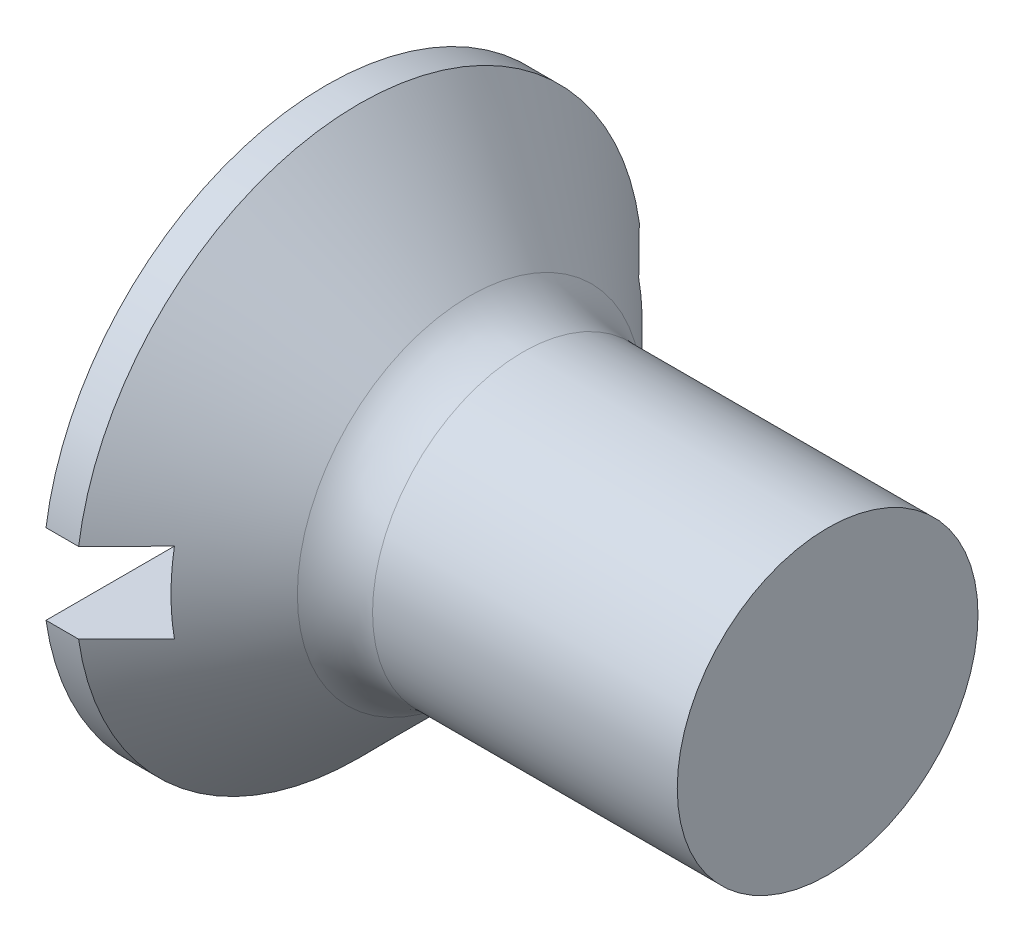
ISO-10303-21;
HEADER;
FILE_DESCRIPTION(('STEP AP214'),'2;1');
FILE_NAME('part.step','',(''),(''),'','','');
FILE_SCHEMA(('AUTOMOTIVE_DESIGN { 1 0 10303 214 1 1 1 1 }'));
ENDSEC;
DATA;
#1=APPLICATION_CONTEXT('core data for automotive mechanical design processes');
#2=APPLICATION_PROTOCOL_DEFINITION('international standard','automotive_design',2000,#1);
#3=PRODUCT_CONTEXT('',#1,'mechanical');
#4=PRODUCT('Part','Part','',(#3));
#5=PRODUCT_RELATED_PRODUCT_CATEGORY('part','',(#4));
#6=PRODUCT_DEFINITION_FORMATION('','',#4);
#7=PRODUCT_DEFINITION_CONTEXT('part definition',#1,'design');
#8=PRODUCT_DEFINITION('design','',#6,#7);
#9=PRODUCT_DEFINITION_SHAPE('','',#8);
#10=(LENGTH_UNIT() NAMED_UNIT(*) SI_UNIT(.MILLI.,.METRE.));
#11=(NAMED_UNIT(*) PLANE_ANGLE_UNIT() SI_UNIT($,.RADIAN.));
#12=(NAMED_UNIT(*) SI_UNIT($,.STERADIAN.) SOLID_ANGLE_UNIT());
#13=UNCERTAINTY_MEASURE_WITH_UNIT(LENGTH_MEASURE(1.E-05),#10,'distance_accuracy_value','');
#14=(GEOMETRIC_REPRESENTATION_CONTEXT(3) GLOBAL_UNCERTAINTY_ASSIGNED_CONTEXT((#13)) GLOBAL_UNIT_ASSIGNED_CONTEXT((#10,
#11,#12)) REPRESENTATION_CONTEXT('',''));
#15=CARTESIAN_POINT('',(0.,0.,0.));
#16=DIRECTION('',(0.,0.,1.));
#17=DIRECTION('',(1.,0.,0.));
#18=AXIS2_PLACEMENT_3D('',#15,#16,#17);
#19=CARTESIAN_POINT('',(0.,0.,0.));
#20=DIRECTION('',(-1.,0.,0.));
#21=DIRECTION('',(0.,0.,1.));
#22=AXIS2_PLACEMENT_3D('',#19,#20,#21);
#23=PLANE('',#22);
#24=DIRECTION('',(0.,0.,-1.));
#25=VECTOR('',#24,1.);
#26=CARTESIAN_POINT('',(0.,0.800000000000001,5.65));
#27=LINE('',#26,#25);
#28=CARTESIAN_POINT('',(0.,0.800000000000001,5.593076076722));
#29=VERTEX_POINT('',#28);
#30=CARTESIAN_POINT('',(0.,0.799999999999999,-5.593076076722));
#31=VERTEX_POINT('',#30);
#32=EDGE_CURVE('E169',#29,#31,#27,.T.);
#33=ORIENTED_EDGE('',*,*,#32,.F.);
#34=CARTESIAN_POINT('',(0.,0.,0.));
#35=DIRECTION('',(-1.,0.,0.));
#36=DIRECTION('',(0.,0.,1.));
#37=AXIS2_PLACEMENT_3D('',#34,#35,#36);
#38=CIRCLE('',#37,5.65);
#39=EDGE_CURVE('E113',#29,#31,#38,.T.);
#40=ORIENTED_EDGE('',*,*,#39,.T.);
#41=EDGE_LOOP('',(#33,#40));
#42=FACE_BOUND('',#41,.T.);
#43=ADVANCED_FACE('F32',(#42),#23,.T.);
#44=CARTESIAN_POINT('',(-6.34999999999999,0.,0.));
#45=DIRECTION('',(-1.,0.,0.));
#46=DIRECTION('',(0.,0.,1.));
#47=AXIS2_PLACEMENT_3D('',#44,#45,#46);
#48=CYLINDRICAL_SURFACE('',#47,5.65);
#49=DIRECTION('',(-1.,0.,0.));
#50=VECTOR('',#49,1.);
#51=CARTESIAN_POINT('',(-6.34999999999999,0.799999999999999,-5.593076076722));
#52=LINE('',#51,#50);
#53=CARTESIAN_POINT('',(0.650000000000011,0.799999999999999,-5.593076076722));
#54=VERTEX_POINT('',#53);
#55=EDGE_CURVE('E60',#31,#54,#52,.F.);
#56=ORIENTED_EDGE('',*,*,#55,.F.);
#57=ORIENTED_EDGE('',*,*,#39,.F.);
#58=DIRECTION('',(-1.,0.,0.));
#59=VECTOR('',#58,1.);
#60=CARTESIAN_POINT('',(-6.34999999999999,0.800000000000001,5.593076076722));
#61=LINE('',#60,#59);
#62=CARTESIAN_POINT('',(0.650000000000011,0.800000000000001,5.59307607672201));
#63=VERTEX_POINT('',#62);
#64=EDGE_CURVE('E175',#63,#29,#61,.T.);
#65=ORIENTED_EDGE('',*,*,#64,.F.);
#66=CARTESIAN_POINT('',(0.650000000000012,0.,0.));
#67=DIRECTION('',(-1.,0.,0.));
#68=DIRECTION('',(0.,0.,1.));
#69=AXIS2_PLACEMENT_3D('',#66,#67,#68);
#70=CIRCLE('',#69,5.65);
#71=EDGE_CURVE('E107',#63,#54,#70,.T.);
#72=ORIENTED_EDGE('',*,*,#71,.T.);
#73=EDGE_LOOP('',(#56,#57,#65,#72));
#74=FACE_BOUND('',#73,.T.);
#75=ADVANCED_FACE('F153',(#74),#48,.T.);
#76=DIRECTION('',(0.,0.,1.));
#77=VECTOR('',#76,1.);
#78=CARTESIAN_POINT('',(0.,-0.800000000000001,-5.65));
#79=LINE('',#78,#77);
#80=CARTESIAN_POINT('',(0.,-0.800000000000001,-5.593076076722));
#81=VERTEX_POINT('',#80);
#82=CARTESIAN_POINT('',(0.,-0.800000000000001,5.593076076722));
#83=VERTEX_POINT('',#82);
#84=EDGE_CURVE('E101',#81,#83,#79,.T.);
#85=ORIENTED_EDGE('',*,*,#84,.F.);
#86=EDGE_CURVE('E109',#81,#83,#38,.T.);
#87=ORIENTED_EDGE('',*,*,#86,.T.);
#88=EDGE_LOOP('',(#85,#87));
#89=FACE_BOUND('',#88,.T.);
#90=ADVANCED_FACE('F155',(#89),#23,.T.);
#91=DIRECTION('',(-1.,0.,0.));
#92=VECTOR('',#91,1.);
#93=CARTESIAN_POINT('',(-6.34999999999999,-0.800000000000001,5.593076076722));
#94=LINE('',#93,#92);
#95=CARTESIAN_POINT('',(0.650000000000011,-0.800000000000001,5.593076076722));
#96=VERTEX_POINT('',#95);
#97=EDGE_CURVE('E174',#83,#96,#94,.F.);
#98=ORIENTED_EDGE('',*,*,#97,.F.);
#99=ORIENTED_EDGE('',*,*,#86,.F.);
#100=DIRECTION('',(-1.,0.,0.));
#101=VECTOR('',#100,1.);
#102=CARTESIAN_POINT('',(-6.34999999999999,-0.800000000000001,-5.593076076722));
#103=LINE('',#102,#101);
#104=CARTESIAN_POINT('',(0.650000000000011,-0.800000000000001,-5.59307607672201));
#105=VERTEX_POINT('',#104);
#106=EDGE_CURVE('E172',#105,#81,#103,.T.);
#107=ORIENTED_EDGE('',*,*,#106,.F.);
#108=EDGE_CURVE('E110',#105,#96,#70,.T.);
#109=ORIENTED_EDGE('',*,*,#108,.T.);
#110=EDGE_LOOP('',(#98,#99,#107,#109));
#111=FACE_BOUND('',#110,.T.);
#112=ADVANCED_FACE('F150',(#111),#48,.T.);
#113=CARTESIAN_POINT('',(0.650000000000012,0.,0.));
#114=DIRECTION('',(-1.,0.,0.));
#115=DIRECTION('',(0.,0.,1.));
#116=AXIS2_PLACEMENT_3D('',#113,#114,#115);
#117=CONICAL_SURFACE('',#116,5.65,0.78539816339745);
#118=CARTESIAN_POINT('',(-6.15411798892372,0.799999999999998,-12.4283971163636));
#119=CARTESIAN_POINT('',(-5.72840936577509,0.799999999999998,-12.0018006229212));
#120=CARTESIAN_POINT('',(-5.30273955990164,0.799999999999998,-11.5751653687947));
#121=CARTESIAN_POINT('',(-4.45151919492078,0.799999999999999,-10.7217600802515));
#122=CARTESIAN_POINT('',(-4.0259686381804,0.799999999999999,-10.2949900434739));
#123=CARTESIAN_POINT('',(-3.17486613013246,0.799999999999999,-9.44109511849879));
#124=CARTESIAN_POINT('',(-2.74931425281385,0.799999999999999,-9.01397015654169));
#125=CARTESIAN_POINT('',(-1.89848797936659,0.799999999999999,-8.15945937404006));
#126=CARTESIAN_POINT('',(-1.47321357834264,0.799999999999999,-7.73207355836998));
#127=CARTESIAN_POINT('',(-0.615833138596042,0.799999999999999,-6.86957346722668));
#128=CARTESIAN_POINT('',(-0.183734469882892,0.799999999999999,-6.43445186100299));
#129=CARTESIAN_POINT('',(0.463821474491267,0.799999999999999,-5.78115808219935));
#130=CARTESIAN_POINT('',(0.679580862520891,0.799999999999999,-5.56328543468081));
#131=CARTESIAN_POINT('',(1.11080934749388,0.799999999999999,-5.12725542215657));
#132=CARTESIAN_POINT('',(1.32627844606598,0.799999999999999,-4.90909805876196));
#133=CARTESIAN_POINT('',(1.75673850138855,0.799999999999999,-4.4724245478013));
#134=CARTESIAN_POINT('',(1.9717295687097,0.799999999999999,-4.25390850932614));
#135=CARTESIAN_POINT('',(2.40105661992232,0.799999999999999,-3.81622451922108));
#136=CARTESIAN_POINT('',(2.61539258957473,0.799999999999999,-3.5970565536225));
#137=CARTESIAN_POINT('',(3.04295786491517,0.799999999999999,-3.15768240489524));
#138=CARTESIAN_POINT('',(3.25618727824565,0.8,-2.93747632688459));
#139=CARTESIAN_POINT('',(3.5744618622097,0.8,-2.60566790210966));
#140=CARTESIAN_POINT('',(3.68028997071699,0.8,-2.49481715360701));
#141=CARTESIAN_POINT('',(3.89117220729709,0.8,-2.27238250941067));
#142=CARTESIAN_POINT('',(3.9962263454492,0.8,-2.16079862330045));
#143=CARTESIAN_POINT('',(4.15723188894845,0.8,-1.98794766988223));
#144=CARTESIAN_POINT('',(4.2136059990957,0.8,-1.92707456228058));
#145=CARTESIAN_POINT('',(4.32589442529992,0.8,-1.80490303802935));
#146=CARTESIAN_POINT('',(4.38180873303286,0.8,-1.74360461371695));
#147=CARTESIAN_POINT('',(4.4929680078689,0.8,-1.62051315034739));
#148=CARTESIAN_POINT('',(4.54821358275828,0.8,-1.55872066097201));
#149=CARTESIAN_POINT('',(4.65786130918919,0.8,-1.43439270817013));
#150=CARTESIAN_POINT('',(4.71226349046958,0.8,-1.37185727107863));
#151=CARTESIAN_POINT('',(4.80409800489935,0.8,-1.26422341554116));
#152=CARTESIAN_POINT('',(4.84183289735226,0.8,-1.21938356763917));
#153=CARTESIAN_POINT('',(4.91649705496834,0.8,-1.12903902209597));
#154=CARTESIAN_POINT('',(4.9534263571778,0.8,-1.08353435518884));
#155=CARTESIAN_POINT('',(5.02626757436238,0.8,-0.991556943863383));
#156=CARTESIAN_POINT('',(5.06217715923927,0.8,-0.945082346844529));
#157=CARTESIAN_POINT('',(5.13244697424572,0.8,-0.850978080642057));
#158=CARTESIAN_POINT('',(5.16680749256612,0.8,-0.803348628866251));
#159=CARTESIAN_POINT('',(5.22431678505691,0.8,-0.719551181360363));
#160=CARTESIAN_POINT('',(5.24799439430335,0.8,-0.683748053381672));
#161=CARTESIAN_POINT('',(5.29369463170906,0.8,-0.611104859400517));
#162=CARTESIAN_POINT('',(5.31571771437161,0.8,-0.574265082019199));
#163=CARTESIAN_POINT('',(5.35744088173564,0.8,-0.499381880581155));
#164=CARTESIAN_POINT('',(5.3771460797954,0.8,-0.461341350063789));
#165=CARTESIAN_POINT('',(5.41336597509922,0.8,-0.383789778924322));
#166=CARTESIAN_POINT('',(5.42988361613627,0.8,-0.344280135684756));
#167=CARTESIAN_POINT('',(5.46094186112705,0.8,-0.256815833575109));
#168=CARTESIAN_POINT('',(5.47467792038231,0.8,-0.20856153602771));
#169=CARTESIAN_POINT('',(5.49381672990303,0.8,-0.110515093237376));
#170=CARTESIAN_POINT('',(5.49925037850747,0.8,-0.060729356954277));
#171=CARTESIAN_POINT('',(5.50060502700805,0.8,0.0392177136115987));
#172=CARTESIAN_POINT('',(5.49648099608259,0.8,0.0893797114709912));
#173=CARTESIAN_POINT('',(5.47960475780969,0.8,0.188284885251787));
#174=CARTESIAN_POINT('',(5.46682661842948,0.8,0.237023336329289));
#175=CARTESIAN_POINT('',(5.43411335720119,0.8,0.334650620188543));
#176=CARTESIAN_POINT('',(5.41385237186613,0.8,0.383425158293348));
#177=CARTESIAN_POINT('',(5.36862340606944,0.8,0.478778012709488));
#178=CARTESIAN_POINT('',(5.34364665533211,0.8,0.525352031468063));
#179=CARTESIAN_POINT('',(5.29038044021314,0.8,0.617035607546896));
#180=CARTESIAN_POINT('',(5.26206586010344,0.8,0.662130306879412));
#181=CARTESIAN_POINT('',(5.20333288339617,0.8,0.750853253487644));
#182=CARTESIAN_POINT('',(5.1729163682235,0.8,0.794482761561326));
#183=CARTESIAN_POINT('',(5.10778188580205,0.8,0.884555028346779));
#184=CARTESIAN_POINT('',(5.0729236209393,0.8,0.930895621053307));
#185=CARTESIAN_POINT('',(5.00196098633506,0.8,1.02261602365522));
#186=CARTESIAN_POINT('',(4.96585645074892,0.8,1.06799570437294));
#187=CARTESIAN_POINT('',(4.85617422837835,0.8,1.20309114485919));
#188=CARTESIAN_POINT('',(4.78126095309617,0.8,1.2917191660263));
#189=CARTESIAN_POINT('',(4.62929001014889,0.8,1.46737217769587));
#190=CARTESIAN_POINT('',(4.55222874448881,0.8,1.5543940152484));
#191=CARTESIAN_POINT('',(4.39684690056853,0.8,1.72725932532418));
#192=CARTESIAN_POINT('',(4.31852668700296,0.8,1.81310312620707));
#193=CARTESIAN_POINT('',(4.16128761098344,0.8,1.9837284827919));
#194=CARTESIAN_POINT('',(4.0823714818107,0.8,2.06851256588975));
#195=CARTESIAN_POINT('',(3.92393847595694,0.8,2.23752833083242));
#196=CARTESIAN_POINT('',(3.84442155665824,0.8,2.32175997268229));
#197=CARTESIAN_POINT('',(3.68503997077844,0.8,2.48972216949868));
#198=CARTESIAN_POINT('',(3.60517576659222,0.8,2.57345316373664));
#199=CARTESIAN_POINT('',(3.44512383250757,0.8,2.74060127143915));
#200=CARTESIAN_POINT('',(3.36493611048112,0.8,2.82401839244668));
#201=CARTESIAN_POINT('',(3.12470885427914,0.8,3.07317891766216));
#202=CARTESIAN_POINT('',(2.96430275212163,0.8,3.23856877786796));
#203=CARTESIAN_POINT('',(2.64287426918782,0.8,3.56874884446275));
#204=CARTESIAN_POINT('',(2.4818518859131,0.8,3.73353904841542));
#205=CARTESIAN_POINT('',(1.9981683934421,0.8,4.22731783608694));
#206=CARTESIAN_POINT('',(1.67489699835289,0.8,4.55570835097942));
#207=CARTESIAN_POINT('',(1.02739846590984,0.8,5.21181717990758));
#208=CARTESIAN_POINT('',(0.70317098349403,0.800000000000001,5.53953515275434));
#209=CARTESIAN_POINT('',(0.0542289424000233,0.800000000000001,6.1944827659075));
#210=CARTESIAN_POINT('',(-0.270485611958639,0.800000000000001,6.52171241049384));
#211=CARTESIAN_POINT('',(-0.920234045040373,0.800000000000001,7.17587674443067));
#212=CARTESIAN_POINT('',(-1.24526793436538,0.800000000000001,7.50281142324595));
#213=CARTESIAN_POINT('',(-1.8955454823201,0.800000000000001,8.15647358657788));
#214=CARTESIAN_POINT('',(-2.220789141434,0.800000000000001,8.48320107061281));
#215=CARTESIAN_POINT('',(-3.19666835146251,0.800000000000001,9.46309907333131));
#216=CARTESIAN_POINT('',(-3.84752047784227,0.800000000000001,10.1160538883214));
#217=CARTESIAN_POINT('',(-4.6364721110691,0.800000000000001,10.9071774138025));
#218=CARTESIAN_POINT('',(-4.77442315271538,0.800000000000001,11.0454942565746));
#219=CARTESIAN_POINT('',(-5.05034059357145,0.800000000000001,11.3221169050327));
#220=CARTESIAN_POINT('',(-5.18830699298625,0.800000000000001,11.4604227105142));
#221=CARTESIAN_POINT('',(-5.46424249913599,0.800000000000001,11.7370137404173));
#222=CARTESIAN_POINT('',(-5.60221160511629,0.800000000000001,11.8752989655918));
#223=CARTESIAN_POINT('',(-5.8781582272092,0.800000000000001,12.1518567391849));
#224=CARTESIAN_POINT('',(-6.01613574315794,0.800000000000001,12.2901292877671));
#225=CARTESIAN_POINT('',(-6.15411798892373,0.800000000000001,12.4283971163636));
#226=B_SPLINE_CURVE_WITH_KNOTS('',3,(#118,#119,#120,#121,#122,#123,#124,#125,#126,#127,#128,
#129,#130,#131,#132,#133,#134,#135,#136,#137,#138,#139,#140,#141,#142,#143,#144,#145,#146,#147,
#148,#149,#150,#151,#152,#153,#154,#155,#156,#157,#158,#159,#160,#161,#162,#163,#164,#165,#166,
#167,#168,#169,#170,#171,#172,#173,#174,#175,#176,#177,#178,#179,#180,#181,#182,#183,#184,#185,
#186,#187,#188,#189,#190,#191,#192,#193,#194,#195,#196,#197,#198,#199,#200,#201,#202,#203,#204,
#205,#206,#207,#208,#209,#210,#211,#212,#213,#214,#215,#216,#217,#218,#219,#220,#221,#222,#223,
#224,#225),.UNSPECIFIED.,.F.,.F.,(4,2,2,2,2,2,2,2,2,2,2,2,2,2,2,2,2,2,2,2,2,2,2,2,2,2,2,2,2,2,2,
2,2,2,2,2,2,2,2,2,2,2,2,2,2,2,2,2,2,2,2,2,2,4),(0.,1.80801318574398,3.61606002416268,
5.42486373753752,7.23363462668577,9.07329711581007,9.9931803026374,10.9130583065872,
11.8326950803875,12.7523517030412,13.6719171211812,14.1316838097536,14.5914445002367,
14.8403447660973,15.0892495280436,15.337907900706,15.5865574854064,15.7623655297245,
15.9381654721253,16.1143391977023,16.2904800112272,16.4192204883151,16.5479254697141,
16.6763409745907,16.8046373107736,16.9545930649754,17.1039893711688,17.2540909851769,
17.4046443803707,17.5627244136479,17.7211013893969,17.8807569429501,18.0402713962385,
18.2142039613079,18.3881597619715,18.7362365983485,19.0849364110538,19.4335369697428,
19.7810170655503,20.1285220460768,20.4756556886262,20.8227809349082,21.5139763758824,
22.2051746219491,23.5875972119713,24.9706017845621,26.3535941638193,27.7366341246983,
29.1196772893733,31.8854728090327,32.4715260084283,33.0575882976692,33.6436126136047,
34.2296278291312),.UNSPECIFIED.);
#227=CARTESIAN_POINT('',(1.6,0.8,4.63141447076377));
#228=VERTEX_POINT('',#227);
#229=EDGE_CURVE('E11',#228,#63,#226,.T.);
#230=ORIENTED_EDGE('',*,*,#229,.F.);
#231=CARTESIAN_POINT('',(1.6,0.,0.));
#232=DIRECTION('',(1.,0.,0.));
#233=DIRECTION('',(0.,0.,-1.));
#234=AXIS2_PLACEMENT_3D('',#231,#232,#233);
#235=CIRCLE('',#234,4.70000000000001);
#236=CARTESIAN_POINT('',(1.6,-0.800000000000001,4.63141447076377));
#237=VERTEX_POINT('',#236);
#238=EDGE_CURVE('E89',#237,#228,#235,.F.);
#239=ORIENTED_EDGE('',*,*,#238,.F.);
#240=CARTESIAN_POINT('',(-6.15411798892373,-0.800000000000001,12.4283971163636));
#241=CARTESIAN_POINT('',(-5.7284093657751,-0.800000000000001,12.0018006229212));
#242=CARTESIAN_POINT('',(-5.30273955990164,-0.800000000000001,11.5751653687947));
#243=CARTESIAN_POINT('',(-4.45151919492079,-0.800000000000001,10.7217600802515));
#244=CARTESIAN_POINT('',(-4.0259686381804,-0.800000000000001,10.2949900434739));
#245=CARTESIAN_POINT('',(-3.17486613013246,-0.800000000000001,9.4410951184988));
#246=CARTESIAN_POINT('',(-2.74931425281386,-0.800000000000001,9.0139701565417));
#247=CARTESIAN_POINT('',(-1.89848797936659,-0.800000000000001,8.15945937404007));
#248=CARTESIAN_POINT('',(-1.47321357834264,-0.800000000000001,7.73207355836998));
#249=CARTESIAN_POINT('',(-0.615833138596046,-0.800000000000001,6.86957346722668));
#250=CARTESIAN_POINT('',(-0.183734469882895,-0.800000000000001,6.434451861003));
#251=CARTESIAN_POINT('',(0.463821474491264,-0.800000000000001,5.78115808219935));
#252=CARTESIAN_POINT('',(0.679580862520888,-0.800000000000001,5.56328543468081));
#253=CARTESIAN_POINT('',(1.11080934749388,-0.800000000000001,5.12725542215657));
#254=CARTESIAN_POINT('',(1.32627844606597,-0.800000000000001,4.90909805876196));
#255=CARTESIAN_POINT('',(1.75673850138855,-0.800000000000001,4.4724245478013));
#256=CARTESIAN_POINT('',(1.9717295687097,-0.800000000000001,4.25390850932614));
#257=CARTESIAN_POINT('',(2.40105661992232,-0.800000000000001,3.81622451922108));
#258=CARTESIAN_POINT('',(2.61539258957473,-0.800000000000001,3.5970565536225));
#259=CARTESIAN_POINT('',(3.04295786491517,-0.800000000000001,3.15768240489524));
#260=CARTESIAN_POINT('',(3.25618727824565,-0.800000000000001,2.93747632688459));
#261=CARTESIAN_POINT('',(3.5744618622097,-0.800000000000001,2.60566790210966));
#262=CARTESIAN_POINT('',(3.68028997071699,-0.800000000000001,2.49481715360701));
#263=CARTESIAN_POINT('',(3.89117220729709,-0.800000000000001,2.27238250941067));
#264=CARTESIAN_POINT('',(3.9962263454492,-0.800000000000001,2.16079862330045));
#265=CARTESIAN_POINT('',(4.15723188894845,-0.800000000000001,1.98794766988223));
#266=CARTESIAN_POINT('',(4.2136059990957,-0.800000000000001,1.92707456228058));
#267=CARTESIAN_POINT('',(4.32589442529992,-0.800000000000001,1.80490303802935));
#268=CARTESIAN_POINT('',(4.38180873303286,-0.800000000000001,1.74360461371695));
#269=CARTESIAN_POINT('',(4.4929680078689,-0.800000000000001,1.62051315034739));
#270=CARTESIAN_POINT('',(4.54821358275828,-0.800000000000001,1.55872066097201));
#271=CARTESIAN_POINT('',(4.65786130918919,-0.800000000000001,1.43439270817013));
#272=CARTESIAN_POINT('',(4.71226349046958,-0.800000000000001,1.37185727107863));
#273=CARTESIAN_POINT('',(4.80409800489935,-0.800000000000001,1.26422341554116));
#274=CARTESIAN_POINT('',(4.84183289735226,-0.800000000000001,1.21938356763917));
#275=CARTESIAN_POINT('',(4.91649705496834,-0.800000000000001,1.12903902209597));
#276=CARTESIAN_POINT('',(4.9534263571778,-0.800000000000001,1.08353435518884));
#277=CARTESIAN_POINT('',(5.02626757436238,-0.800000000000001,0.991556943863385));
#278=CARTESIAN_POINT('',(5.06217715923927,-0.800000000000001,0.945082346844531));
#279=CARTESIAN_POINT('',(5.13244697424572,-0.800000000000001,0.850978080642059));
#280=CARTESIAN_POINT('',(5.16680749256612,-0.800000000000001,0.803348628866253));
#281=CARTESIAN_POINT('',(5.22431678505691,-0.800000000000001,0.719551181360366));
#282=CARTESIAN_POINT('',(5.24799439430334,-0.800000000000001,0.683748053381674));
#283=CARTESIAN_POINT('',(5.29369463170906,-0.800000000000001,0.61110485940052));
#284=CARTESIAN_POINT('',(5.31571771437161,-0.800000000000001,0.574265082019201));
#285=CARTESIAN_POINT('',(5.35744088173564,-0.800000000000001,0.499381880581156));
#286=CARTESIAN_POINT('',(5.3771460797954,-0.800000000000001,0.461341350063788));
#287=CARTESIAN_POINT('',(5.41336597509922,-0.800000000000001,0.38378977892432));
#288=CARTESIAN_POINT('',(5.42988361613627,-0.800000000000001,0.344280135684754));
#289=CARTESIAN_POINT('',(5.46094186112705,-0.800000000000001,0.256815833575107));
#290=CARTESIAN_POINT('',(5.47467792038231,-0.800000000000001,0.208561536027708));
#291=CARTESIAN_POINT('',(5.49381672990303,-0.800000000000001,0.110515093237374));
#292=CARTESIAN_POINT('',(5.49925037850747,-0.800000000000001,0.0607293569542746));
#293=CARTESIAN_POINT('',(5.50060502700805,-0.800000000000001,-0.0392177136116001));
#294=CARTESIAN_POINT('',(5.49648099608259,-0.800000000000001,-0.0893797114709915));
#295=CARTESIAN_POINT('',(5.47960475780968,-0.800000000000001,-0.188284885251788));
#296=CARTESIAN_POINT('',(5.46682661842948,-0.800000000000001,-0.237023336329291));
#297=CARTESIAN_POINT('',(5.43411335720119,-0.800000000000001,-0.334650620188546));
#298=CARTESIAN_POINT('',(5.41385237186613,-0.800000000000001,-0.383425158293352));
#299=CARTESIAN_POINT('',(5.36862340606944,-0.800000000000001,-0.478778012709493));
#300=CARTESIAN_POINT('',(5.34364665533211,-0.800000000000001,-0.525352031468069));
#301=CARTESIAN_POINT('',(5.29038044021314,-0.800000000000001,-0.617035607546902));
#302=CARTESIAN_POINT('',(5.26206586010343,-0.800000000000001,-0.662130306879419));
#303=CARTESIAN_POINT('',(5.20333288339616,-0.800000000000001,-0.750853253487651));
#304=CARTESIAN_POINT('',(5.1729163682235,-0.800000000000001,-0.794482761561333));
#305=CARTESIAN_POINT('',(5.10778188580204,-0.800000000000001,-0.884555028346787));
#306=CARTESIAN_POINT('',(5.07292362093929,-0.800000000000001,-0.930895621053317));
#307=CARTESIAN_POINT('',(5.00196098633505,-0.800000000000001,-1.02261602365523));
#308=CARTESIAN_POINT('',(4.96585645074891,-0.800000000000001,-1.06799570437295));
#309=CARTESIAN_POINT('',(4.85617422837834,-0.800000000000001,-1.2030911448592));
#310=CARTESIAN_POINT('',(4.78126095309615,-0.800000000000001,-1.29171916602632));
#311=CARTESIAN_POINT('',(4.62929001014888,-0.800000000000001,-1.46737217769588));
#312=CARTESIAN_POINT('',(4.55222874448879,-0.800000000000001,-1.55439401524842));
#313=CARTESIAN_POINT('',(4.39684690056851,-0.800000000000001,-1.7272593253242));
#314=CARTESIAN_POINT('',(4.31852668700294,-0.800000000000001,-1.81310312620709));
#315=CARTESIAN_POINT('',(4.16128761098342,-0.800000000000001,-1.98372848279192));
#316=CARTESIAN_POINT('',(4.08237148181068,-0.800000000000001,-2.06851256588977));
#317=CARTESIAN_POINT('',(3.92393847595692,-0.800000000000001,-2.23752833083244));
#318=CARTESIAN_POINT('',(3.84442155665822,-0.800000000000001,-2.32175997268231));
#319=CARTESIAN_POINT('',(3.68503997077842,-0.800000000000001,-2.48972216949871));
#320=CARTESIAN_POINT('',(3.60517576659219,-0.800000000000001,-2.57345316373666));
#321=CARTESIAN_POINT('',(3.44512383250754,-0.800000000000001,-2.74060127143917));
#322=CARTESIAN_POINT('',(3.36493611048109,-0.800000000000001,-2.82401839244671));
#323=CARTESIAN_POINT('',(3.12470885427911,-0.800000000000001,-3.07317891766219));
#324=CARTESIAN_POINT('',(2.9643027521216,-0.800000000000001,-3.238568777868));
#325=CARTESIAN_POINT('',(2.64287426918778,-0.800000000000001,-3.56874884446279));
#326=CARTESIAN_POINT('',(2.48185188591306,-0.800000000000001,-3.73353904841546));
#327=CARTESIAN_POINT('',(1.99816839344205,-0.800000000000001,-4.22731783608699));
#328=CARTESIAN_POINT('',(1.67489699835283,-0.800000000000001,-4.55570835097947));
#329=CARTESIAN_POINT('',(1.02739846590978,-0.800000000000001,-5.21181717990763));
#330=CARTESIAN_POINT('',(0.703170983493969,-0.800000000000001,-5.5395351527544));
#331=CARTESIAN_POINT('',(0.0542289423999557,-0.800000000000001,-6.19448276590757));
#332=CARTESIAN_POINT('',(-0.270485611958711,-0.800000000000001,-6.52171241049391));
#333=CARTESIAN_POINT('',(-0.920234045040452,-0.800000000000001,-7.17587674443075));
#334=CARTESIAN_POINT('',(-1.24526793436547,-0.800000000000001,-7.50281142324603));
#335=CARTESIAN_POINT('',(-1.89554548232019,-0.800000000000001,-8.15647358657797));
#336=CARTESIAN_POINT('',(-2.22078914143409,-0.800000000000001,-8.48320107061291));
#337=CARTESIAN_POINT('',(-3.19666835146261,-0.800000000000001,-9.46309907333142));
#338=CARTESIAN_POINT('',(-3.84752047784239,-0.800000000000001,-10.1160538883215));
#339=CARTESIAN_POINT('',(-4.63647211106921,-0.800000000000001,-10.9071774138026));
#340=CARTESIAN_POINT('',(-4.77442315271548,-0.800000000000001,-11.0454942565747));
#341=CARTESIAN_POINT('',(-5.05034059357153,-0.800000000000001,-11.3221169050328));
#342=CARTESIAN_POINT('',(-5.18830699298632,-0.800000000000001,-11.4604227105142));
#343=CARTESIAN_POINT('',(-5.46424249913604,-0.800000000000001,-11.7370137404173));
#344=CARTESIAN_POINT('',(-5.60221160511633,-0.800000000000001,-11.8752989655918));
#345=CARTESIAN_POINT('',(-5.87815822720923,-0.800000000000001,-12.151856739185));
#346=CARTESIAN_POINT('',(-6.01613574315795,-0.800000000000001,-12.2901292877671));
#347=CARTESIAN_POINT('',(-6.15411798892373,-0.800000000000001,-12.4283971163636));
#348=B_SPLINE_CURVE_WITH_KNOTS('',3,(#240,#241,#242,#243,#244,#245,#246,#247,#248,#249,#250,
#251,#252,#253,#254,#255,#256,#257,#258,#259,#260,#261,#262,#263,#264,#265,#266,#267,#268,#269,
#270,#271,#272,#273,#274,#275,#276,#277,#278,#279,#280,#281,#282,#283,#284,#285,#286,#287,#288,
#289,#290,#291,#292,#293,#294,#295,#296,#297,#298,#299,#300,#301,#302,#303,#304,#305,#306,#307,
#308,#309,#310,#311,#312,#313,#314,#315,#316,#317,#318,#319,#320,#321,#322,#323,#324,#325,#326,
#327,#328,#329,#330,#331,#332,#333,#334,#335,#336,#337,#338,#339,#340,#341,#342,#343,#344,#345,
#346,#347),.UNSPECIFIED.,.F.,.F.,(4,2,2,2,2,2,2,2,2,2,2,2,2,2,2,2,2,2,2,2,2,2,2,2,2,2,2,2,2,2,2,
2,2,2,2,2,2,2,2,2,2,2,2,2,2,2,2,2,2,2,2,2,2,4),(0.,1.80801318574398,3.61606002416268,
5.42486373753751,7.23363462668576,9.07329711581006,9.99318030263739,10.9130583065872,
11.8326950803875,12.7523517030412,13.6719171211812,14.1316838097536,14.5914445002367,
14.8403447660973,15.0892495280436,15.337907900706,15.5865574854064,15.7623655297245,
15.9381654721253,16.1143391977023,16.2904800112272,16.4192204883151,16.5479254697141,
16.6763409745907,16.8046373107736,16.9545930649754,17.1039893711688,17.2540909851769,
17.4046443803707,17.5627244136479,17.7211013893969,17.8807569429501,18.0402713962385,
18.2142039613079,18.3881597619715,18.7362365983485,19.0849364110538,19.4335369697428,
19.7810170655504,20.1285220460768,20.4756556886263,20.8227809349082,21.5139763758825,
22.2051746219492,23.5875972119713,24.9706017845622,26.3535941638194,27.7366341246984,
29.1196772893735,31.8854728090329,32.4715260084284,33.0575882976693,33.6436126136047,
34.2296278291312),.UNSPECIFIED.);
#349=EDGE_CURVE('E46',#96,#237,#348,.T.);
#350=ORIENTED_EDGE('',*,*,#349,.F.);
#351=ORIENTED_EDGE('',*,*,#108,.F.);
#352=CARTESIAN_POINT('',(1.6,-0.800000000000001,-4.63141447076377));
#353=VERTEX_POINT('',#352);
#354=EDGE_CURVE('E125',#353,#105,#348,.T.);
#355=ORIENTED_EDGE('',*,*,#354,.F.);
#356=CARTESIAN_POINT('',(1.6,0.799999999999999,-4.63141447076377));
#357=VERTEX_POINT('',#356);
#358=EDGE_CURVE('E97',#357,#353,#235,.F.);
#359=ORIENTED_EDGE('',*,*,#358,.F.);
#360=EDGE_CURVE('E36',#54,#357,#226,.T.);
#361=ORIENTED_EDGE('',*,*,#360,.F.);
#362=ORIENTED_EDGE('',*,*,#71,.F.);
#363=EDGE_LOOP('',(#230,#239,#350,#351,#355,#359,#361,#362));
#364=FACE_BOUND('',#363,.T.);
#365=CARTESIAN_POINT('',(2.86066017177982,0.,0.));
#366=DIRECTION('',(-1.,0.,0.));
#367=DIRECTION('',(0.,0.,1.));
#368=AXIS2_PLACEMENT_3D('',#365,#366,#367);
#369=CIRCLE('',#368,3.43933982822018);
#370=CARTESIAN_POINT('',(2.86066017177982,0.,3.43933982822018));
#371=VERTEX_POINT('',#370);
#372=EDGE_CURVE('E120',#371,#371,#369,.T.);
#373=ORIENTED_EDGE('',*,*,#372,.T.);
#374=EDGE_LOOP('',(#373));
#375=FACE_BOUND('',#374,.T.);
#376=ADVANCED_FACE('F104',(#364,#375),#117,.T.);
#377=CARTESIAN_POINT('',(-6.34999999999999,0.,0.));
#378=DIRECTION('',(-1.,0.,0.));
#379=DIRECTION('',(0.,0.,1.));
#380=AXIS2_PLACEMENT_3D('',#377,#378,#379);
#381=CYLINDRICAL_SURFACE('',#380,3.);
#382=CARTESIAN_POINT('',(3.92132034355964,0.,0.));
#383=DIRECTION('',(-1.,0.,0.));
#384=DIRECTION('',(0.,0.,1.));
#385=AXIS2_PLACEMENT_3D('',#382,#383,#384);
#386=CIRCLE('',#385,3.);
#387=CARTESIAN_POINT('',(3.92132034355964,0.,3.));
#388=VERTEX_POINT('',#387);
#389=EDGE_CURVE('E123',#388,#388,#386,.F.);
#390=ORIENTED_EDGE('',*,*,#389,.T.);
#391=EDGE_LOOP('',(#390));
#392=FACE_BOUND('',#391,.T.);
#393=CARTESIAN_POINT('',(10.,0.,0.));
#394=DIRECTION('',(-1.,0.,0.));
#395=DIRECTION('',(0.,0.,1.));
#396=AXIS2_PLACEMENT_3D('',#393,#394,#395);
#397=CIRCLE('',#396,3.);
#398=CARTESIAN_POINT('',(10.,0.,3.));
#399=VERTEX_POINT('',#398);
#400=EDGE_CURVE('E116',#399,#399,#397,.T.);
#401=ORIENTED_EDGE('',*,*,#400,.T.);
#402=EDGE_LOOP('',(#401));
#403=FACE_BOUND('',#402,.T.);
#404=ADVANCED_FACE('F143',(#392,#403),#381,.T.);
#405=CARTESIAN_POINT('',(10.,3.,0.));
#406=DIRECTION('',(1.,0.,0.));
#407=DIRECTION('',(0.,0.,-1.));
#408=AXIS2_PLACEMENT_3D('',#405,#406,#407);
#409=PLANE('',#408);
#410=ORIENTED_EDGE('',*,*,#400,.F.);
#411=EDGE_LOOP('',(#410));
#412=FACE_BOUND('',#411,.T.);
#413=ADVANCED_FACE('F141',(#412),#409,.T.);
#414=CARTESIAN_POINT('',(3.92132034355964,0.,0.));
#415=DIRECTION('',(-1.,0.,0.));
#416=DIRECTION('',(0.,0.,1.));
#417=AXIS2_PLACEMENT_3D('',#414,#415,#416);
#418=TOROIDAL_SURFACE('',#417,4.5,1.5);
#419=ORIENTED_EDGE('',*,*,#389,.F.);
#420=EDGE_LOOP('',(#419));
#421=FACE_BOUND('',#420,.T.);
#422=ORIENTED_EDGE('',*,*,#372,.F.);
#423=EDGE_LOOP('',(#422));
#424=FACE_BOUND('',#423,.T.);
#425=ADVANCED_FACE('F34',(#421,#424),#418,.F.);
#426=CARTESIAN_POINT('',(1.6,0.800000000000001,5.65));
#427=DIRECTION('',(0.,1.,0.));
#428=DIRECTION('',(0.,0.,1.));
#429=AXIS2_PLACEMENT_3D('',#426,#427,#428);
#430=PLANE('',#429);
#431=ORIENTED_EDGE('',*,*,#55,.T.);
#432=ORIENTED_EDGE('',*,*,#360,.T.);
#433=DIRECTION('',(0.,0.,-1.));
#434=VECTOR('',#433,1.);
#435=CARTESIAN_POINT('',(1.6,0.800000000000001,5.65));
#436=LINE('',#435,#434);
#437=EDGE_CURVE('E53',#228,#357,#436,.T.);
#438=ORIENTED_EDGE('',*,*,#437,.F.);
#439=ORIENTED_EDGE('',*,*,#229,.T.);
#440=ORIENTED_EDGE('',*,*,#64,.T.);
#441=ORIENTED_EDGE('',*,*,#32,.T.);
#442=EDGE_LOOP('',(#431,#432,#438,#439,#440,#441));
#443=FACE_BOUND('',#442,.T.);
#444=ADVANCED_FACE('F98',(#443),#430,.F.);
#445=CARTESIAN_POINT('',(1.6,-0.800000000000001,-5.65));
#446=DIRECTION('',(0.,-1.,0.));
#447=DIRECTION('',(0.,0.,-1.));
#448=AXIS2_PLACEMENT_3D('',#445,#446,#447);
#449=PLANE('',#448);
#450=ORIENTED_EDGE('',*,*,#97,.T.);
#451=ORIENTED_EDGE('',*,*,#349,.T.);
#452=DIRECTION('',(0.,0.,1.));
#453=VECTOR('',#452,1.);
#454=CARTESIAN_POINT('',(1.6,-0.800000000000001,-5.65));
#455=LINE('',#454,#453);
#456=EDGE_CURVE('E92',#353,#237,#455,.T.);
#457=ORIENTED_EDGE('',*,*,#456,.F.);
#458=ORIENTED_EDGE('',*,*,#354,.T.);
#459=ORIENTED_EDGE('',*,*,#106,.T.);
#460=ORIENTED_EDGE('',*,*,#84,.T.);
#461=EDGE_LOOP('',(#450,#451,#457,#458,#459,#460));
#462=FACE_BOUND('',#461,.T.);
#463=ADVANCED_FACE('F133',(#462),#449,.F.);
#464=CARTESIAN_POINT('',(1.6,-0.800000000000001,-5.65));
#465=DIRECTION('',(1.,0.,0.));
#466=DIRECTION('',(0.,0.,-1.));
#467=AXIS2_PLACEMENT_3D('',#464,#465,#466);
#468=PLANE('',#467);
#469=ORIENTED_EDGE('',*,*,#238,.T.);
#470=ORIENTED_EDGE('',*,*,#437,.T.);
#471=ORIENTED_EDGE('',*,*,#358,.T.);
#472=ORIENTED_EDGE('',*,*,#456,.T.);
#473=EDGE_LOOP('',(#469,#470,#471,#472));
#474=FACE_BOUND('',#473,.T.);
#475=ADVANCED_FACE('F90',(#474),#468,.F.);
#476=CLOSED_SHELL('',(#43,#75,#90,#112,#376,#404,#413,#425,#444,#463,#475));
#477=MANIFOLD_SOLID_BREP('B2',#476);
#478=ADVANCED_BREP_SHAPE_REPRESENTATION('',(#18,#477),#14);
#479=SHAPE_DEFINITION_REPRESENTATION(#9,#478);
ENDSEC;
END-ISO-10303-21;
